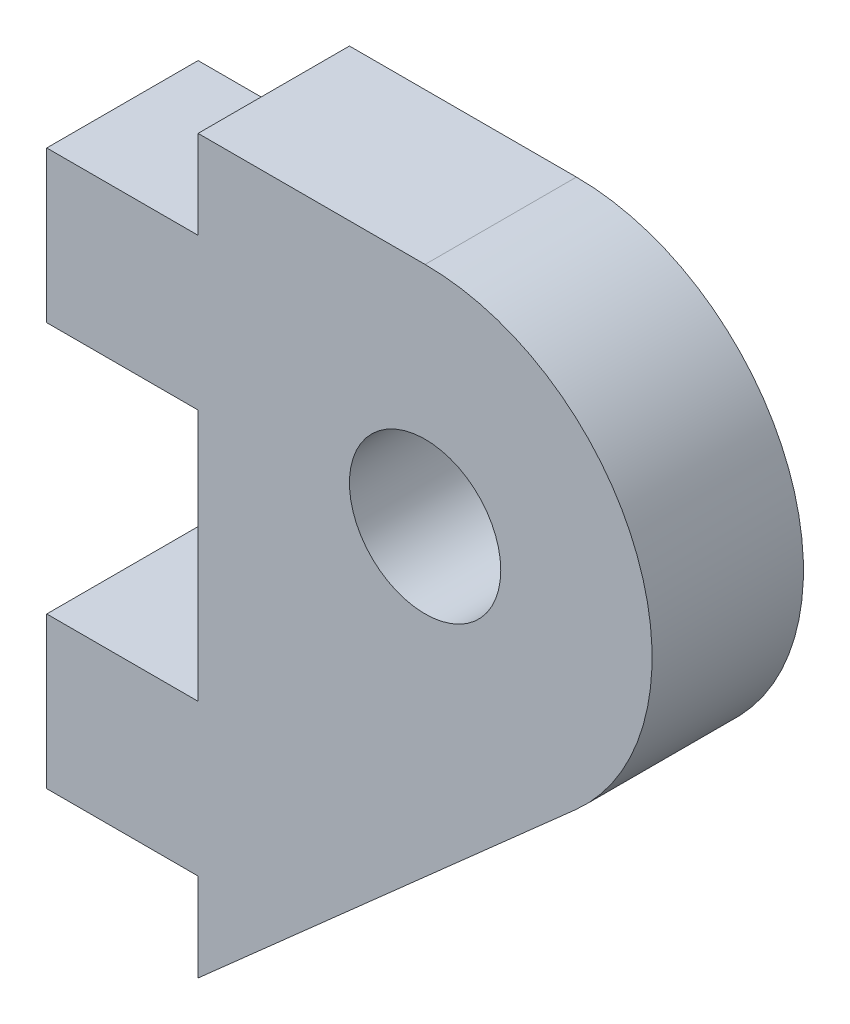
ISO-10303-21;
HEADER;
FILE_DESCRIPTION(('STEP AP214'),'2;1');
FILE_NAME('part.step','',(''),(''),'','','');
FILE_SCHEMA(('AUTOMOTIVE_DESIGN { 1 0 10303 214 1 1 1 1 }'));
ENDSEC;
DATA;
#1=APPLICATION_CONTEXT('core data for automotive mechanical design processes');
#2=APPLICATION_PROTOCOL_DEFINITION('international standard','automotive_design',2000,#1);
#3=PRODUCT_CONTEXT('',#1,'mechanical');
#4=PRODUCT('Part','Part','',(#3));
#5=PRODUCT_RELATED_PRODUCT_CATEGORY('part','',(#4));
#6=PRODUCT_DEFINITION_FORMATION('','',#4);
#7=PRODUCT_DEFINITION_CONTEXT('part definition',#1,'design');
#8=PRODUCT_DEFINITION('design','',#6,#7);
#9=PRODUCT_DEFINITION_SHAPE('','',#8);
#10=(LENGTH_UNIT() NAMED_UNIT(*) SI_UNIT(.MILLI.,.METRE.));
#11=(NAMED_UNIT(*) PLANE_ANGLE_UNIT() SI_UNIT($,.RADIAN.));
#12=(NAMED_UNIT(*) SI_UNIT($,.STERADIAN.) SOLID_ANGLE_UNIT());
#13=UNCERTAINTY_MEASURE_WITH_UNIT(LENGTH_MEASURE(1.E-05),#10,'distance_accuracy_value','');
#14=(GEOMETRIC_REPRESENTATION_CONTEXT(3) GLOBAL_UNCERTAINTY_ASSIGNED_CONTEXT((#13)) GLOBAL_UNIT_ASSIGNED_CONTEXT((#10,
#11,#12)) REPRESENTATION_CONTEXT('',''));
#15=CARTESIAN_POINT('',(0.,0.,0.));
#16=DIRECTION('',(0.,0.,1.));
#17=DIRECTION('',(1.,0.,0.));
#18=AXIS2_PLACEMENT_3D('',#15,#16,#17);
#19=CARTESIAN_POINT('',(0.,0.,1.5));
#20=DIRECTION('',(1.,0.,0.));
#21=DIRECTION('',(0.,0.,-1.));
#22=AXIS2_PLACEMENT_3D('',#19,#20,#21);
#23=PLANE('',#22);
#24=DIRECTION('',(0.,0.,1.));
#25=VECTOR('',#24,1.);
#26=CARTESIAN_POINT('',(0.,1.75,-1.5));
#27=LINE('',#26,#25);
#28=CARTESIAN_POINT('',(0.,1.75,-1.5));
#29=VERTEX_POINT('',#28);
#30=CARTESIAN_POINT('',(0.,1.75,1.5));
#31=VERTEX_POINT('',#30);
#32=EDGE_CURVE('E235',#29,#31,#27,.T.);
#33=ORIENTED_EDGE('',*,*,#32,.F.);
#34=DIRECTION('',(0.,-1.,0.));
#35=VECTOR('',#34,1.);
#36=CARTESIAN_POINT('',(0.,0.,-1.5));
#37=LINE('',#36,#35);
#38=CARTESIAN_POINT('',(0.,0.,-1.5));
#39=VERTEX_POINT('',#38);
#40=EDGE_CURVE('E145',#29,#39,#37,.T.);
#41=ORIENTED_EDGE('',*,*,#40,.T.);
#42=DIRECTION('',(0.,0.,-1.));
#43=VECTOR('',#42,1.);
#44=CARTESIAN_POINT('',(0.,0.,1.5));
#45=LINE('',#44,#43);
#46=CARTESIAN_POINT('',(0.,0.,1.5));
#47=VERTEX_POINT('',#46);
#48=EDGE_CURVE('E196',#47,#39,#45,.T.);
#49=ORIENTED_EDGE('',*,*,#48,.F.);
#50=DIRECTION('',(0.,-1.,0.));
#51=VECTOR('',#50,1.);
#52=CARTESIAN_POINT('',(0.,14.5,1.5));
#53=LINE('',#52,#51);
#54=EDGE_CURVE('E47',#31,#47,#53,.T.);
#55=ORIENTED_EDGE('',*,*,#54,.F.);
#56=EDGE_LOOP('',(#33,#41,#49,#55));
#57=FACE_BOUND('',#56,.T.);
#58=ADVANCED_FACE('F32',(#57),#23,.F.);
#59=DIRECTION('',(0.,0.,-1.));
#60=VECTOR('',#59,1.);
#61=CARTESIAN_POINT('',(0.,4.75,-1.5));
#62=LINE('',#61,#60);
#63=CARTESIAN_POINT('',(0.,4.75,1.5));
#64=VERTEX_POINT('',#63);
#65=CARTESIAN_POINT('',(0.,4.75,-1.5));
#66=VERTEX_POINT('',#65);
#67=EDGE_CURVE('E55',#64,#66,#62,.T.);
#68=ORIENTED_EDGE('',*,*,#67,.F.);
#69=CARTESIAN_POINT('',(0.,9.75,1.5));
#70=VERTEX_POINT('',#69);
#71=EDGE_CURVE('E197',#70,#64,#53,.T.);
#72=ORIENTED_EDGE('',*,*,#71,.F.);
#73=DIRECTION('',(0.,0.,1.));
#74=VECTOR('',#73,1.);
#75=CARTESIAN_POINT('',(0.,9.75,-1.5));
#76=LINE('',#75,#74);
#77=CARTESIAN_POINT('',(0.,9.75,-1.5));
#78=VERTEX_POINT('',#77);
#79=EDGE_CURVE('E149',#78,#70,#76,.T.);
#80=ORIENTED_EDGE('',*,*,#79,.F.);
#81=EDGE_CURVE('E206',#78,#66,#37,.T.);
#82=ORIENTED_EDGE('',*,*,#81,.T.);
#83=EDGE_LOOP('',(#68,#72,#80,#82));
#84=FACE_BOUND('',#83,.T.);
#85=ADVANCED_FACE('F237',(#84),#23,.F.);
#86=DIRECTION('',(0.,0.,-1.));
#87=VECTOR('',#86,1.);
#88=CARTESIAN_POINT('',(0.,12.75,-1.5));
#89=LINE('',#88,#87);
#90=CARTESIAN_POINT('',(0.,12.75,1.5));
#91=VERTEX_POINT('',#90);
#92=CARTESIAN_POINT('',(0.,12.75,-1.5));
#93=VERTEX_POINT('',#92);
#94=EDGE_CURVE('E146',#91,#93,#89,.T.);
#95=ORIENTED_EDGE('',*,*,#94,.F.);
#96=CARTESIAN_POINT('',(0.,14.5,1.5));
#97=VERTEX_POINT('',#96);
#98=EDGE_CURVE('E193',#97,#91,#53,.T.);
#99=ORIENTED_EDGE('',*,*,#98,.F.);
#100=DIRECTION('',(0.,0.,-1.));
#101=VECTOR('',#100,1.);
#102=CARTESIAN_POINT('',(0.,14.5,1.5));
#103=LINE('',#102,#101);
#104=CARTESIAN_POINT('',(0.,14.5,-1.5));
#105=VERTEX_POINT('',#104);
#106=EDGE_CURVE('E209',#97,#105,#103,.T.);
#107=ORIENTED_EDGE('',*,*,#106,.T.);
#108=EDGE_CURVE('E189',#105,#93,#37,.T.);
#109=ORIENTED_EDGE('',*,*,#108,.T.);
#110=EDGE_LOOP('',(#95,#99,#107,#109));
#111=FACE_BOUND('',#110,.T.);
#112=ADVANCED_FACE('F222',(#111),#23,.F.);
#113=CARTESIAN_POINT('',(4.5,10.,1.5));
#114=DIRECTION('',(0.,0.,1.));
#115=DIRECTION('',(1.,0.,0.));
#116=AXIS2_PLACEMENT_3D('',#113,#114,#115);
#117=PLANE('',#116);
#118=DIRECTION('',(0.748440748440748,0.663201663201663,0.));
#119=VECTOR('',#118,1.);
#120=CARTESIAN_POINT('',(7.48440748440748,6.63201663201663,1.5));
#121=LINE('',#120,#119);
#122=CARTESIAN_POINT('',(7.48440748440748,6.63201663201663,1.5));
#123=VERTEX_POINT('',#122);
#124=EDGE_CURVE('E185',#47,#123,#121,.T.);
#125=ORIENTED_EDGE('',*,*,#124,.T.);
#126=CARTESIAN_POINT('',(4.5,10.,1.5));
#127=DIRECTION('',(0.,0.,1.));
#128=DIRECTION('',(1.,0.,0.));
#129=AXIS2_PLACEMENT_3D('',#126,#127,#128);
#130=CIRCLE('',#129,4.5);
#131=CARTESIAN_POINT('',(4.5,14.5,1.5));
#132=VERTEX_POINT('',#131);
#133=EDGE_CURVE('E188',#123,#132,#130,.T.);
#134=ORIENTED_EDGE('',*,*,#133,.T.);
#135=DIRECTION('',(-1.,0.,0.));
#136=VECTOR('',#135,1.);
#137=CARTESIAN_POINT('',(4.5,14.5,1.5));
#138=LINE('',#137,#136);
#139=EDGE_CURVE('E191',#132,#97,#138,.T.);
#140=ORIENTED_EDGE('',*,*,#139,.T.);
#141=ORIENTED_EDGE('',*,*,#98,.T.);
#142=DIRECTION('',(1.,0.,0.));
#143=VECTOR('',#142,1.);
#144=CARTESIAN_POINT('',(-3.,12.75,1.5));
#145=LINE('',#144,#143);
#146=CARTESIAN_POINT('',(-3.,12.75,1.5));
#147=VERTEX_POINT('',#146);
#148=EDGE_CURVE('E175',#147,#91,#145,.T.);
#149=ORIENTED_EDGE('',*,*,#148,.F.);
#150=DIRECTION('',(0.,1.,0.));
#151=VECTOR('',#150,1.);
#152=CARTESIAN_POINT('',(-3.,12.75,1.5));
#153=LINE('',#152,#151);
#154=CARTESIAN_POINT('',(-3.,9.75,1.5));
#155=VERTEX_POINT('',#154);
#156=EDGE_CURVE('E155',#155,#147,#153,.T.);
#157=ORIENTED_EDGE('',*,*,#156,.F.);
#158=DIRECTION('',(1.,0.,0.));
#159=VECTOR('',#158,1.);
#160=CARTESIAN_POINT('',(-3.,9.75,1.5));
#161=LINE('',#160,#159);
#162=EDGE_CURVE('E163',#155,#70,#161,.T.);
#163=ORIENTED_EDGE('',*,*,#162,.T.);
#164=ORIENTED_EDGE('',*,*,#71,.T.);
#165=DIRECTION('',(1.,0.,0.));
#166=VECTOR('',#165,1.);
#167=CARTESIAN_POINT('',(-3.,4.75,1.5));
#168=LINE('',#167,#166);
#169=CARTESIAN_POINT('',(-3.,4.75,1.5));
#170=VERTEX_POINT('',#169);
#171=EDGE_CURVE('E151',#170,#64,#168,.T.);
#172=ORIENTED_EDGE('',*,*,#171,.F.);
#173=DIRECTION('',(0.,1.,0.));
#174=VECTOR('',#173,1.);
#175=CARTESIAN_POINT('',(-3.,1.75,1.5));
#176=LINE('',#175,#174);
#177=CARTESIAN_POINT('',(-3.,1.75,1.5));
#178=VERTEX_POINT('',#177);
#179=EDGE_CURVE('E131',#178,#170,#176,.T.);
#180=ORIENTED_EDGE('',*,*,#179,.F.);
#181=DIRECTION('',(1.,0.,0.));
#182=VECTOR('',#181,1.);
#183=CARTESIAN_POINT('',(-3.,1.75,1.5));
#184=LINE('',#183,#182);
#185=EDGE_CURVE('E128',#178,#31,#184,.T.);
#186=ORIENTED_EDGE('',*,*,#185,.T.);
#187=ORIENTED_EDGE('',*,*,#54,.T.);
#188=EDGE_LOOP('',(#125,#134,#140,#141,#149,#157,#163,#164,#172,#180,#186,#187));
#189=FACE_BOUND('',#188,.T.);
#190=CARTESIAN_POINT('',(4.5,10.,1.5));
#191=DIRECTION('',(0.,0.,1.));
#192=DIRECTION('',(1.,0.,0.));
#193=AXIS2_PLACEMENT_3D('',#190,#191,#192);
#194=CIRCLE('',#193,1.5);
#195=CARTESIAN_POINT('',(6.,10.,1.5));
#196=VERTEX_POINT('',#195);
#197=EDGE_CURVE('E179',#196,#196,#194,.T.);
#198=ORIENTED_EDGE('',*,*,#197,.F.);
#199=EDGE_LOOP('',(#198));
#200=FACE_BOUND('',#199,.T.);
#201=ADVANCED_FACE('F229',(#189,#200),#117,.T.);
#202=CARTESIAN_POINT('',(4.5,10.,-1.5));
#203=DIRECTION('',(0.,0.,1.));
#204=DIRECTION('',(1.,0.,0.));
#205=AXIS2_PLACEMENT_3D('',#202,#203,#204);
#206=PLANE('',#205);
#207=DIRECTION('',(0.748440748440748,0.663201663201663,0.));
#208=VECTOR('',#207,1.);
#209=CARTESIAN_POINT('',(7.48440748440748,6.63201663201663,-1.5));
#210=LINE('',#209,#208);
#211=CARTESIAN_POINT('',(7.48440748440748,6.63201663201663,-1.5));
#212=VERTEX_POINT('',#211);
#213=EDGE_CURVE('E182',#39,#212,#210,.T.);
#214=ORIENTED_EDGE('',*,*,#213,.F.);
#215=ORIENTED_EDGE('',*,*,#40,.F.);
#216=DIRECTION('',(1.,0.,0.));
#217=VECTOR('',#216,1.);
#218=CARTESIAN_POINT('',(-3.,1.75,-1.5));
#219=LINE('',#218,#217);
#220=CARTESIAN_POINT('',(-3.,1.75,-1.5));
#221=VERTEX_POINT('',#220);
#222=EDGE_CURVE('E126',#221,#29,#219,.T.);
#223=ORIENTED_EDGE('',*,*,#222,.F.);
#224=DIRECTION('',(0.,-1.,0.));
#225=VECTOR('',#224,1.);
#226=CARTESIAN_POINT('',(-3.,1.75,-1.5));
#227=LINE('',#226,#225);
#228=CARTESIAN_POINT('',(-3.,4.75,-1.5));
#229=VERTEX_POINT('',#228);
#230=EDGE_CURVE('E132',#229,#221,#227,.T.);
#231=ORIENTED_EDGE('',*,*,#230,.F.);
#232=DIRECTION('',(1.,0.,0.));
#233=VECTOR('',#232,1.);
#234=CARTESIAN_POINT('',(-3.,4.75,-1.5));
#235=LINE('',#234,#233);
#236=EDGE_CURVE('E242',#229,#66,#235,.T.);
#237=ORIENTED_EDGE('',*,*,#236,.T.);
#238=ORIENTED_EDGE('',*,*,#81,.F.);
#239=DIRECTION('',(1.,0.,0.));
#240=VECTOR('',#239,1.);
#241=CARTESIAN_POINT('',(-3.,9.75,-1.5));
#242=LINE('',#241,#240);
#243=CARTESIAN_POINT('',(-3.,9.75,-1.5));
#244=VERTEX_POINT('',#243);
#245=EDGE_CURVE('E169',#244,#78,#242,.T.);
#246=ORIENTED_EDGE('',*,*,#245,.F.);
#247=DIRECTION('',(0.,-1.,0.));
#248=VECTOR('',#247,1.);
#249=CARTESIAN_POINT('',(-3.,12.75,-1.5));
#250=LINE('',#249,#248);
#251=CARTESIAN_POINT('',(-3.,12.75,-1.5));
#252=VERTEX_POINT('',#251);
#253=EDGE_CURVE('E160',#252,#244,#250,.T.);
#254=ORIENTED_EDGE('',*,*,#253,.F.);
#255=DIRECTION('',(1.,0.,0.));
#256=VECTOR('',#255,1.);
#257=CARTESIAN_POINT('',(-3.,12.75,-1.5));
#258=LINE('',#257,#256);
#259=EDGE_CURVE('E172',#252,#93,#258,.T.);
#260=ORIENTED_EDGE('',*,*,#259,.T.);
#261=ORIENTED_EDGE('',*,*,#108,.F.);
#262=DIRECTION('',(-1.,0.,0.));
#263=VECTOR('',#262,1.);
#264=CARTESIAN_POINT('',(4.5,14.5,-1.5));
#265=LINE('',#264,#263);
#266=CARTESIAN_POINT('',(4.5,14.5,-1.5));
#267=VERTEX_POINT('',#266);
#268=EDGE_CURVE('E202',#267,#105,#265,.T.);
#269=ORIENTED_EDGE('',*,*,#268,.F.);
#270=CARTESIAN_POINT('',(4.5,10.,-1.5));
#271=DIRECTION('',(0.,0.,1.));
#272=DIRECTION('',(1.,0.,0.));
#273=AXIS2_PLACEMENT_3D('',#270,#271,#272);
#274=CIRCLE('',#273,4.5);
#275=EDGE_CURVE('E200',#212,#267,#274,.T.);
#276=ORIENTED_EDGE('',*,*,#275,.F.);
#277=EDGE_LOOP('',(#214,#215,#223,#231,#237,#238,#246,#254,#260,#261,#269,#276));
#278=FACE_BOUND('',#277,.T.);
#279=CARTESIAN_POINT('',(4.5,10.,-1.5));
#280=DIRECTION('',(0.,0.,1.));
#281=DIRECTION('',(1.,0.,0.));
#282=AXIS2_PLACEMENT_3D('',#279,#280,#281);
#283=CIRCLE('',#282,1.5);
#284=CARTESIAN_POINT('',(6.,10.,-1.5));
#285=VERTEX_POINT('',#284);
#286=EDGE_CURVE('E178',#285,#285,#283,.T.);
#287=ORIENTED_EDGE('',*,*,#286,.T.);
#288=EDGE_LOOP('',(#287));
#289=FACE_BOUND('',#288,.T.);
#290=ADVANCED_FACE('F143',(#278,#289),#206,.F.);
#291=CARTESIAN_POINT('',(7.48440748440748,6.63201663201663,1.5));
#292=DIRECTION('',(-0.663201663201663,0.748440748440748,0.));
#293=DIRECTION('',(-0.748440748440748,-0.663201663201663,0.));
#294=AXIS2_PLACEMENT_3D('',#291,#292,#293);
#295=PLANE('',#294);
#296=ORIENTED_EDGE('',*,*,#213,.T.);
#297=DIRECTION('',(0.,0.,-1.));
#298=VECTOR('',#297,1.);
#299=CARTESIAN_POINT('',(7.48440748440748,6.63201663201663,1.5));
#300=LINE('',#299,#298);
#301=EDGE_CURVE('E11',#123,#212,#300,.T.);
#302=ORIENTED_EDGE('',*,*,#301,.F.);
#303=ORIENTED_EDGE('',*,*,#124,.F.);
#304=ORIENTED_EDGE('',*,*,#48,.T.);
#305=EDGE_LOOP('',(#296,#302,#303,#304));
#306=FACE_BOUND('',#305,.T.);
#307=ADVANCED_FACE('F34',(#306),#295,.F.);
#308=CARTESIAN_POINT('',(4.5,10.,1.5));
#309=DIRECTION('',(0.,0.,-1.));
#310=DIRECTION('',(-1.,0.,0.));
#311=AXIS2_PLACEMENT_3D('',#308,#309,#310);
#312=CYLINDRICAL_SURFACE('',#311,4.5);
#313=ORIENTED_EDGE('',*,*,#275,.T.);
#314=DIRECTION('',(0.,0.,-1.));
#315=VECTOR('',#314,1.);
#316=CARTESIAN_POINT('',(4.5,14.5,1.5));
#317=LINE('',#316,#315);
#318=EDGE_CURVE('E40',#132,#267,#317,.T.);
#319=ORIENTED_EDGE('',*,*,#318,.F.);
#320=ORIENTED_EDGE('',*,*,#133,.F.);
#321=ORIENTED_EDGE('',*,*,#301,.T.);
#322=EDGE_LOOP('',(#313,#319,#320,#321));
#323=FACE_BOUND('',#322,.T.);
#324=ADVANCED_FACE('F233',(#323),#312,.T.);
#325=CARTESIAN_POINT('',(4.5,14.5,1.5));
#326=DIRECTION('',(0.,-1.,0.));
#327=DIRECTION('',(0.,0.,-1.));
#328=AXIS2_PLACEMENT_3D('',#325,#326,#327);
#329=PLANE('',#328);
#330=ORIENTED_EDGE('',*,*,#268,.T.);
#331=ORIENTED_EDGE('',*,*,#106,.F.);
#332=ORIENTED_EDGE('',*,*,#139,.F.);
#333=ORIENTED_EDGE('',*,*,#318,.T.);
#334=EDGE_LOOP('',(#330,#331,#332,#333));
#335=FACE_BOUND('',#334,.T.);
#336=ADVANCED_FACE('F216',(#335),#329,.F.);
#337=CARTESIAN_POINT('',(4.5,10.,1.5));
#338=DIRECTION('',(0.,0.,-1.));
#339=DIRECTION('',(-1.,0.,0.));
#340=AXIS2_PLACEMENT_3D('',#337,#338,#339);
#341=CYLINDRICAL_SURFACE('',#340,1.5);
#342=ORIENTED_EDGE('',*,*,#197,.T.);
#343=EDGE_LOOP('',(#342));
#344=FACE_BOUND('',#343,.T.);
#345=ORIENTED_EDGE('',*,*,#286,.F.);
#346=EDGE_LOOP('',(#345));
#347=FACE_BOUND('',#346,.T.);
#348=ADVANCED_FACE('F279',(#344,#347),#341,.F.);
#349=CARTESIAN_POINT('',(-3.,12.75,-1.5));
#350=DIRECTION('',(0.,-1.,0.));
#351=DIRECTION('',(0.,0.,-1.));
#352=AXIS2_PLACEMENT_3D('',#349,#350,#351);
#353=PLANE('',#352);
#354=ORIENTED_EDGE('',*,*,#94,.T.);
#355=ORIENTED_EDGE('',*,*,#259,.F.);
#356=DIRECTION('',(0.,0.,-1.));
#357=VECTOR('',#356,1.);
#358=CARTESIAN_POINT('',(-3.,12.75,-1.5));
#359=LINE('',#358,#357);
#360=EDGE_CURVE('E158',#147,#252,#359,.T.);
#361=ORIENTED_EDGE('',*,*,#360,.F.);
#362=ORIENTED_EDGE('',*,*,#148,.T.);
#363=EDGE_LOOP('',(#354,#355,#361,#362));
#364=FACE_BOUND('',#363,.T.);
#365=ADVANCED_FACE('F225',(#364),#353,.F.);
#366=CARTESIAN_POINT('',(-3.,9.75,-1.5));
#367=DIRECTION('',(0.,1.,0.));
#368=DIRECTION('',(0.,0.,1.));
#369=AXIS2_PLACEMENT_3D('',#366,#367,#368);
#370=PLANE('',#369);
#371=ORIENTED_EDGE('',*,*,#79,.T.);
#372=ORIENTED_EDGE('',*,*,#162,.F.);
#373=DIRECTION('',(0.,0.,1.));
#374=VECTOR('',#373,1.);
#375=CARTESIAN_POINT('',(-3.,9.75,-1.5));
#376=LINE('',#375,#374);
#377=EDGE_CURVE('E162',#244,#155,#376,.T.);
#378=ORIENTED_EDGE('',*,*,#377,.F.);
#379=ORIENTED_EDGE('',*,*,#245,.T.);
#380=EDGE_LOOP('',(#371,#372,#378,#379));
#381=FACE_BOUND('',#380,.T.);
#382=ADVANCED_FACE('F251',(#381),#370,.F.);
#383=CARTESIAN_POINT('',(-3.,0.,0.));
#384=DIRECTION('',(-1.,0.,0.));
#385=DIRECTION('',(0.,0.,1.));
#386=AXIS2_PLACEMENT_3D('',#383,#384,#385);
#387=PLANE('',#386);
#388=ORIENTED_EDGE('',*,*,#156,.T.);
#389=ORIENTED_EDGE('',*,*,#360,.T.);
#390=ORIENTED_EDGE('',*,*,#253,.T.);
#391=ORIENTED_EDGE('',*,*,#377,.T.);
#392=EDGE_LOOP('',(#388,#389,#390,#391));
#393=FACE_BOUND('',#392,.T.);
#394=ADVANCED_FACE('F254',(#393),#387,.T.);
#395=CARTESIAN_POINT('',(-3.,1.75,-1.5));
#396=DIRECTION('',(0.,1.,0.));
#397=DIRECTION('',(0.,0.,1.));
#398=AXIS2_PLACEMENT_3D('',#395,#396,#397);
#399=PLANE('',#398);
#400=ORIENTED_EDGE('',*,*,#32,.T.);
#401=ORIENTED_EDGE('',*,*,#185,.F.);
#402=DIRECTION('',(0.,0.,1.));
#403=VECTOR('',#402,1.);
#404=CARTESIAN_POINT('',(-3.,1.75,-1.5));
#405=LINE('',#404,#403);
#406=EDGE_CURVE('E122',#221,#178,#405,.T.);
#407=ORIENTED_EDGE('',*,*,#406,.F.);
#408=ORIENTED_EDGE('',*,*,#222,.T.);
#409=EDGE_LOOP('',(#400,#401,#407,#408));
#410=FACE_BOUND('',#409,.T.);
#411=ADVANCED_FACE('F124',(#410),#399,.F.);
#412=CARTESIAN_POINT('',(-3.,4.75,-1.5));
#413=DIRECTION('',(0.,-1.,0.));
#414=DIRECTION('',(0.,0.,-1.));
#415=AXIS2_PLACEMENT_3D('',#412,#413,#414);
#416=PLANE('',#415);
#417=ORIENTED_EDGE('',*,*,#67,.T.);
#418=ORIENTED_EDGE('',*,*,#236,.F.);
#419=DIRECTION('',(0.,0.,-1.));
#420=VECTOR('',#419,1.);
#421=CARTESIAN_POINT('',(-3.,4.75,-1.5));
#422=LINE('',#421,#420);
#423=EDGE_CURVE('E137',#170,#229,#422,.T.);
#424=ORIENTED_EDGE('',*,*,#423,.F.);
#425=ORIENTED_EDGE('',*,*,#171,.T.);
#426=EDGE_LOOP('',(#417,#418,#424,#425));
#427=FACE_BOUND('',#426,.T.);
#428=ADVANCED_FACE('F241',(#427),#416,.F.);
#429=CARTESIAN_POINT('',(-3.,0.,0.));
#430=DIRECTION('',(1.,0.,0.));
#431=DIRECTION('',(0.,0.,-1.));
#432=AXIS2_PLACEMENT_3D('',#429,#430,#431);
#433=PLANE('',#432);
#434=ORIENTED_EDGE('',*,*,#230,.T.);
#435=ORIENTED_EDGE('',*,*,#406,.T.);
#436=ORIENTED_EDGE('',*,*,#179,.T.);
#437=ORIENTED_EDGE('',*,*,#423,.T.);
#438=EDGE_LOOP('',(#434,#435,#436,#437));
#439=FACE_BOUND('',#438,.T.);
#440=ADVANCED_FACE('F135',(#439),#433,.F.);
#441=CLOSED_SHELL('',(#58,#85,#112,#201,#290,#307,#324,#336,#348,#365,#382,#394,#411,#428,#440));
#442=MANIFOLD_SOLID_BREP('B2',#441);
#443=ADVANCED_BREP_SHAPE_REPRESENTATION('',(#18,#442),#14);
#444=SHAPE_DEFINITION_REPRESENTATION(#9,#443);
ENDSEC;
END-ISO-10303-21;
